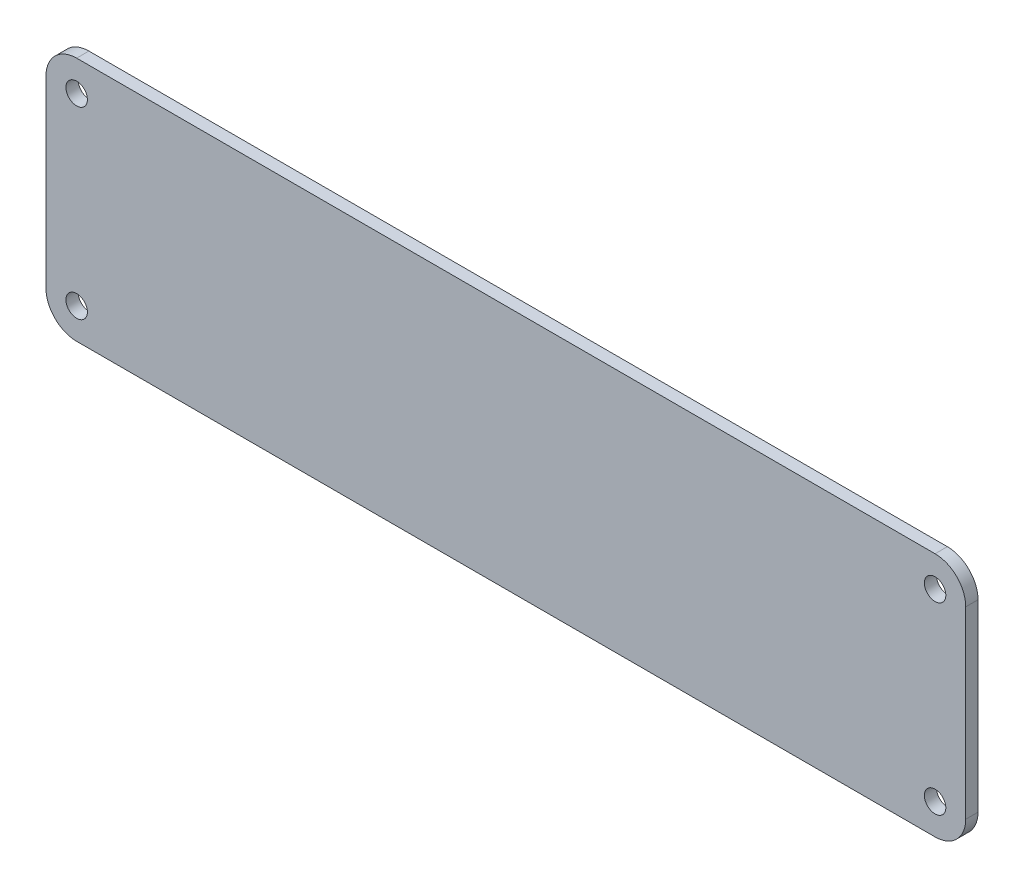
ISO-10303-21;
HEADER;
FILE_DESCRIPTION(('STEP AP214'),'2;1');
FILE_NAME('part.step','',(''),(''),'','','');
FILE_SCHEMA(('AUTOMOTIVE_DESIGN { 1 0 10303 214 1 1 1 1 }'));
ENDSEC;
DATA;
#1=APPLICATION_CONTEXT('core data for automotive mechanical design processes');
#2=APPLICATION_PROTOCOL_DEFINITION('international standard','automotive_design',2000,#1);
#3=PRODUCT_CONTEXT('',#1,'mechanical');
#4=PRODUCT('Part','Part','',(#3));
#5=PRODUCT_RELATED_PRODUCT_CATEGORY('part','',(#4));
#6=PRODUCT_DEFINITION_FORMATION('','',#4);
#7=PRODUCT_DEFINITION_CONTEXT('part definition',#1,'design');
#8=PRODUCT_DEFINITION('design','',#6,#7);
#9=PRODUCT_DEFINITION_SHAPE('','',#8);
#10=(LENGTH_UNIT() NAMED_UNIT(*) SI_UNIT(.MILLI.,.METRE.));
#11=(NAMED_UNIT(*) PLANE_ANGLE_UNIT() SI_UNIT($,.RADIAN.));
#12=(NAMED_UNIT(*) SI_UNIT($,.STERADIAN.) SOLID_ANGLE_UNIT());
#13=UNCERTAINTY_MEASURE_WITH_UNIT(LENGTH_MEASURE(1.E-05),#10,'distance_accuracy_value','');
#14=(GEOMETRIC_REPRESENTATION_CONTEXT(3) GLOBAL_UNCERTAINTY_ASSIGNED_CONTEXT((#13)) GLOBAL_UNIT_ASSIGNED_CONTEXT((#10,
#11,#12)) REPRESENTATION_CONTEXT('',''));
#15=CARTESIAN_POINT('',(0.,0.,0.));
#16=DIRECTION('',(0.,0.,1.));
#17=DIRECTION('',(1.,0.,0.));
#18=AXIS2_PLACEMENT_3D('',#15,#16,#17);
#19=CARTESIAN_POINT('',(-75.,-20.,2.));
#20=DIRECTION('',(1.,0.,0.));
#21=DIRECTION('',(0.,0.,-1.));
#22=AXIS2_PLACEMENT_3D('',#19,#20,#21);
#23=PLANE('',#22);
#24=DIRECTION('',(0.,-1.,0.));
#25=VECTOR('',#24,1.);
#26=CARTESIAN_POINT('',(-75.,-20.,0.));
#27=LINE('',#26,#25);
#28=CARTESIAN_POINT('',(-75.,15.,0.));
#29=VERTEX_POINT('',#28);
#30=CARTESIAN_POINT('',(-75.,-15.,0.));
#31=VERTEX_POINT('',#30);
#32=EDGE_CURVE('E133',#29,#31,#27,.T.);
#33=ORIENTED_EDGE('',*,*,#32,.T.);
#34=DIRECTION('',(0.,0.,-1.));
#35=VECTOR('',#34,1.);
#36=CARTESIAN_POINT('',(-75.,-15.,2.));
#37=LINE('',#36,#35);
#38=CARTESIAN_POINT('',(-75.,-15.,2.));
#39=VERTEX_POINT('',#38);
#40=EDGE_CURVE('E11',#31,#39,#37,.F.);
#41=ORIENTED_EDGE('',*,*,#40,.T.);
#42=DIRECTION('',(0.,-1.,0.));
#43=VECTOR('',#42,1.);
#44=CARTESIAN_POINT('',(-75.,-20.,2.));
#45=LINE('',#44,#43);
#46=CARTESIAN_POINT('',(-75.,15.,2.));
#47=VERTEX_POINT('',#46);
#48=EDGE_CURVE('E131',#47,#39,#45,.T.);
#49=ORIENTED_EDGE('',*,*,#48,.F.);
#50=DIRECTION('',(0.,0.,-1.));
#51=VECTOR('',#50,1.);
#52=CARTESIAN_POINT('',(-75.,15.,2.));
#53=LINE('',#52,#51);
#54=EDGE_CURVE('E45',#47,#29,#53,.T.);
#55=ORIENTED_EDGE('',*,*,#54,.T.);
#56=EDGE_LOOP('',(#33,#41,#49,#55));
#57=FACE_BOUND('',#56,.T.);
#58=ADVANCED_FACE('F37',(#57),#23,.F.);
#59=CARTESIAN_POINT('',(75.,-20.,2.));
#60=DIRECTION('',(0.,1.,0.));
#61=DIRECTION('',(-1.,0.,0.));
#62=AXIS2_PLACEMENT_3D('',#59,#60,#61);
#63=PLANE('',#62);
#64=DIRECTION('',(1.,0.,0.));
#65=VECTOR('',#64,1.);
#66=CARTESIAN_POINT('',(75.,-20.,0.));
#67=LINE('',#66,#65);
#68=CARTESIAN_POINT('',(-70.,-20.,0.));
#69=VERTEX_POINT('',#68);
#70=CARTESIAN_POINT('',(70.,-20.,0.));
#71=VERTEX_POINT('',#70);
#72=EDGE_CURVE('E129',#69,#71,#67,.T.);
#73=ORIENTED_EDGE('',*,*,#72,.T.);
#74=DIRECTION('',(0.,0.,-1.));
#75=VECTOR('',#74,1.);
#76=CARTESIAN_POINT('',(70.,-20.,2.));
#77=LINE('',#76,#75);
#78=CARTESIAN_POINT('',(70.,-20.,2.));
#79=VERTEX_POINT('',#78);
#80=EDGE_CURVE('E108',#71,#79,#77,.F.);
#81=ORIENTED_EDGE('',*,*,#80,.T.);
#82=DIRECTION('',(1.,0.,0.));
#83=VECTOR('',#82,1.);
#84=CARTESIAN_POINT('',(75.,-20.,2.));
#85=LINE('',#84,#83);
#86=CARTESIAN_POINT('',(-70.,-20.,2.));
#87=VERTEX_POINT('',#86);
#88=EDGE_CURVE('E173',#87,#79,#85,.T.);
#89=ORIENTED_EDGE('',*,*,#88,.F.);
#90=DIRECTION('',(0.,0.,-1.));
#91=VECTOR('',#90,1.);
#92=CARTESIAN_POINT('',(-70.,-20.,2.));
#93=LINE('',#92,#91);
#94=EDGE_CURVE('E113',#87,#69,#93,.T.);
#95=ORIENTED_EDGE('',*,*,#94,.T.);
#96=EDGE_LOOP('',(#73,#81,#89,#95));
#97=FACE_BOUND('',#96,.T.);
#98=ADVANCED_FACE('F211',(#97),#63,.F.);
#99=CARTESIAN_POINT('',(75.,-20.,2.));
#100=DIRECTION('',(-1.,0.,0.));
#101=DIRECTION('',(0.,0.,1.));
#102=AXIS2_PLACEMENT_3D('',#99,#100,#101);
#103=PLANE('',#102);
#104=DIRECTION('',(0.,1.,0.));
#105=VECTOR('',#104,1.);
#106=CARTESIAN_POINT('',(75.,-20.,2.));
#107=LINE('',#106,#105);
#108=CARTESIAN_POINT('',(75.,-15.,2.));
#109=VERTEX_POINT('',#108);
#110=CARTESIAN_POINT('',(75.,15.,2.));
#111=VERTEX_POINT('',#110);
#112=EDGE_CURVE('E122',#109,#111,#107,.T.);
#113=ORIENTED_EDGE('',*,*,#112,.F.);
#114=DIRECTION('',(0.,0.,-1.));
#115=VECTOR('',#114,1.);
#116=CARTESIAN_POINT('',(75.,-15.,2.));
#117=LINE('',#116,#115);
#118=CARTESIAN_POINT('',(75.,-15.,0.));
#119=VERTEX_POINT('',#118);
#120=EDGE_CURVE('E107',#109,#119,#117,.T.);
#121=ORIENTED_EDGE('',*,*,#120,.T.);
#122=DIRECTION('',(0.,1.,0.));
#123=VECTOR('',#122,1.);
#124=CARTESIAN_POINT('',(75.,-20.,0.));
#125=LINE('',#124,#123);
#126=CARTESIAN_POINT('',(75.,15.,0.));
#127=VERTEX_POINT('',#126);
#128=EDGE_CURVE('E120',#119,#127,#125,.T.);
#129=ORIENTED_EDGE('',*,*,#128,.T.);
#130=DIRECTION('',(0.,0.,-1.));
#131=VECTOR('',#130,1.);
#132=CARTESIAN_POINT('',(75.,15.,2.));
#133=LINE('',#132,#131);
#134=EDGE_CURVE('E124',#127,#111,#133,.F.);
#135=ORIENTED_EDGE('',*,*,#134,.T.);
#136=EDGE_LOOP('',(#113,#121,#129,#135));
#137=FACE_BOUND('',#136,.T.);
#138=ADVANCED_FACE('F119',(#137),#103,.F.);
#139=CARTESIAN_POINT('',(75.,20.,2.));
#140=DIRECTION('',(0.,-1.,0.));
#141=DIRECTION('',(1.,0.,0.));
#142=AXIS2_PLACEMENT_3D('',#139,#140,#141);
#143=PLANE('',#142);
#144=DIRECTION('',(-1.,0.,0.));
#145=VECTOR('',#144,1.);
#146=CARTESIAN_POINT('',(75.,20.,2.));
#147=LINE('',#146,#145);
#148=CARTESIAN_POINT('',(70.,20.,2.));
#149=VERTEX_POINT('',#148);
#150=CARTESIAN_POINT('',(-70.,20.,2.));
#151=VERTEX_POINT('',#150);
#152=EDGE_CURVE('E137',#149,#151,#147,.T.);
#153=ORIENTED_EDGE('',*,*,#152,.F.);
#154=DIRECTION('',(0.,0.,-1.));
#155=VECTOR('',#154,1.);
#156=CARTESIAN_POINT('',(70.,20.,2.));
#157=LINE('',#156,#155);
#158=CARTESIAN_POINT('',(70.,20.,0.));
#159=VERTEX_POINT('',#158);
#160=EDGE_CURVE('E154',#149,#159,#157,.T.);
#161=ORIENTED_EDGE('',*,*,#160,.T.);
#162=DIRECTION('',(-1.,0.,0.));
#163=VECTOR('',#162,1.);
#164=CARTESIAN_POINT('',(75.,20.,0.));
#165=LINE('',#164,#163);
#166=CARTESIAN_POINT('',(-70.,20.,0.));
#167=VERTEX_POINT('',#166);
#168=EDGE_CURVE('E128',#159,#167,#165,.T.);
#169=ORIENTED_EDGE('',*,*,#168,.T.);
#170=DIRECTION('',(0.,0.,-1.));
#171=VECTOR('',#170,1.);
#172=CARTESIAN_POINT('',(-70.,20.,2.));
#173=LINE('',#172,#171);
#174=EDGE_CURVE('E52',#167,#151,#173,.F.);
#175=ORIENTED_EDGE('',*,*,#174,.T.);
#176=EDGE_LOOP('',(#153,#161,#169,#175));
#177=FACE_BOUND('',#176,.T.);
#178=ADVANCED_FACE('F203',(#177),#143,.F.);
#179=CARTESIAN_POINT('',(0.,0.,2.));
#180=DIRECTION('',(0.,0.,1.));
#181=DIRECTION('',(1.,0.,0.));
#182=AXIS2_PLACEMENT_3D('',#179,#180,#181);
#183=PLANE('',#182);
#184=CARTESIAN_POINT('',(70.,15.,2.));
#185=DIRECTION('',(0.,0.,1.));
#186=DIRECTION('',(1.,0.,0.));
#187=AXIS2_PLACEMENT_3D('',#184,#185,#186);
#188=CIRCLE('',#187,1.75);
#189=CARTESIAN_POINT('',(71.75,15.,2.));
#190=VERTEX_POINT('',#189);
#191=EDGE_CURVE('E183',#190,#190,#188,.T.);
#192=ORIENTED_EDGE('',*,*,#191,.F.);
#193=EDGE_LOOP('',(#192));
#194=FACE_BOUND('',#193,.T.);
#195=CARTESIAN_POINT('',(70.,-15.,2.));
#196=DIRECTION('',(0.,0.,1.));
#197=DIRECTION('',(1.,0.,0.));
#198=AXIS2_PLACEMENT_3D('',#195,#196,#197);
#199=CIRCLE('',#198,1.75);
#200=CARTESIAN_POINT('',(71.75,-15.,2.));
#201=VERTEX_POINT('',#200);
#202=EDGE_CURVE('E189',#201,#201,#199,.T.);
#203=ORIENTED_EDGE('',*,*,#202,.F.);
#204=EDGE_LOOP('',(#203));
#205=FACE_BOUND('',#204,.T.);
#206=CARTESIAN_POINT('',(-70.,-15.,2.));
#207=DIRECTION('',(0.,0.,1.));
#208=DIRECTION('',(1.,0.,0.));
#209=AXIS2_PLACEMENT_3D('',#206,#207,#208);
#210=CIRCLE('',#209,1.75);
#211=CARTESIAN_POINT('',(-68.25,-15.,2.));
#212=VERTEX_POINT('',#211);
#213=EDGE_CURVE('E178',#212,#212,#210,.T.);
#214=ORIENTED_EDGE('',*,*,#213,.F.);
#215=EDGE_LOOP('',(#214));
#216=FACE_BOUND('',#215,.T.);
#217=CARTESIAN_POINT('',(-70.,15.,2.));
#218=DIRECTION('',(0.,0.,1.));
#219=DIRECTION('',(1.,0.,0.));
#220=AXIS2_PLACEMENT_3D('',#217,#218,#219);
#221=CIRCLE('',#220,1.75);
#222=CARTESIAN_POINT('',(-68.25,15.,2.));
#223=VERTEX_POINT('',#222);
#224=EDGE_CURVE('E168',#223,#223,#221,.T.);
#225=ORIENTED_EDGE('',*,*,#224,.F.);
#226=EDGE_LOOP('',(#225));
#227=FACE_BOUND('',#226,.T.);
#228=ORIENTED_EDGE('',*,*,#88,.T.);
#229=CARTESIAN_POINT('',(70.,-15.,2.));
#230=DIRECTION('',(0.,0.,1.));
#231=DIRECTION('',(1.,0.,0.));
#232=AXIS2_PLACEMENT_3D('',#229,#230,#231);
#233=CIRCLE('',#232,5.);
#234=EDGE_CURVE('E151',#79,#109,#233,.T.);
#235=ORIENTED_EDGE('',*,*,#234,.T.);
#236=ORIENTED_EDGE('',*,*,#112,.T.);
#237=CARTESIAN_POINT('',(70.,15.,2.));
#238=DIRECTION('',(0.,0.,1.));
#239=DIRECTION('',(1.,0.,0.));
#240=AXIS2_PLACEMENT_3D('',#237,#238,#239);
#241=CIRCLE('',#240,5.);
#242=EDGE_CURVE('E59',#111,#149,#241,.T.);
#243=ORIENTED_EDGE('',*,*,#242,.T.);
#244=ORIENTED_EDGE('',*,*,#152,.T.);
#245=CARTESIAN_POINT('',(-70.,15.,2.));
#246=DIRECTION('',(0.,0.,1.));
#247=DIRECTION('',(1.,0.,0.));
#248=AXIS2_PLACEMENT_3D('',#245,#246,#247);
#249=CIRCLE('',#248,5.);
#250=EDGE_CURVE('E146',#151,#47,#249,.T.);
#251=ORIENTED_EDGE('',*,*,#250,.T.);
#252=ORIENTED_EDGE('',*,*,#48,.T.);
#253=CARTESIAN_POINT('',(-70.,-15.,2.));
#254=DIRECTION('',(0.,0.,1.));
#255=DIRECTION('',(1.,0.,0.));
#256=AXIS2_PLACEMENT_3D('',#253,#254,#255);
#257=CIRCLE('',#256,5.);
#258=EDGE_CURVE('E148',#39,#87,#257,.T.);
#259=ORIENTED_EDGE('',*,*,#258,.T.);
#260=EDGE_LOOP('',(#228,#235,#236,#243,#244,#251,#252,#259));
#261=FACE_BOUND('',#260,.T.);
#262=ADVANCED_FACE('F200',(#194,#205,#216,#227,#261),#183,.T.);
#263=CARTESIAN_POINT('',(0.,0.,0.));
#264=DIRECTION('',(0.,0.,1.));
#265=DIRECTION('',(1.,0.,0.));
#266=AXIS2_PLACEMENT_3D('',#263,#264,#265);
#267=PLANE('',#266);
#268=CARTESIAN_POINT('',(70.,15.,0.));
#269=DIRECTION('',(0.,0.,1.));
#270=DIRECTION('',(1.,0.,0.));
#271=AXIS2_PLACEMENT_3D('',#268,#269,#270);
#272=CIRCLE('',#271,1.75);
#273=CARTESIAN_POINT('',(71.75,15.,0.));
#274=VERTEX_POINT('',#273);
#275=EDGE_CURVE('E180',#274,#274,#272,.T.);
#276=ORIENTED_EDGE('',*,*,#275,.T.);
#277=EDGE_LOOP('',(#276));
#278=FACE_BOUND('',#277,.T.);
#279=CARTESIAN_POINT('',(70.,-15.,0.));
#280=DIRECTION('',(0.,0.,1.));
#281=DIRECTION('',(1.,0.,0.));
#282=AXIS2_PLACEMENT_3D('',#279,#280,#281);
#283=CIRCLE('',#282,1.75);
#284=CARTESIAN_POINT('',(71.75,-15.,0.));
#285=VERTEX_POINT('',#284);
#286=EDGE_CURVE('E186',#285,#285,#283,.T.);
#287=ORIENTED_EDGE('',*,*,#286,.T.);
#288=EDGE_LOOP('',(#287));
#289=FACE_BOUND('',#288,.T.);
#290=CARTESIAN_POINT('',(-70.,-15.,0.));
#291=DIRECTION('',(0.,0.,1.));
#292=DIRECTION('',(1.,0.,0.));
#293=AXIS2_PLACEMENT_3D('',#290,#291,#292);
#294=CIRCLE('',#293,1.75);
#295=CARTESIAN_POINT('',(-68.25,-15.,0.));
#296=VERTEX_POINT('',#295);
#297=EDGE_CURVE('E192',#296,#296,#294,.T.);
#298=ORIENTED_EDGE('',*,*,#297,.T.);
#299=EDGE_LOOP('',(#298));
#300=FACE_BOUND('',#299,.T.);
#301=CARTESIAN_POINT('',(-70.,15.,0.));
#302=DIRECTION('',(0.,0.,1.));
#303=DIRECTION('',(1.,0.,0.));
#304=AXIS2_PLACEMENT_3D('',#301,#302,#303);
#305=CIRCLE('',#304,1.75);
#306=CARTESIAN_POINT('',(-68.25,15.,0.));
#307=VERTEX_POINT('',#306);
#308=EDGE_CURVE('E166',#307,#307,#305,.T.);
#309=ORIENTED_EDGE('',*,*,#308,.T.);
#310=EDGE_LOOP('',(#309));
#311=FACE_BOUND('',#310,.T.);
#312=ORIENTED_EDGE('',*,*,#128,.F.);
#313=CARTESIAN_POINT('',(70.,-15.,0.));
#314=DIRECTION('',(0.,0.,1.));
#315=DIRECTION('',(1.,0.,0.));
#316=AXIS2_PLACEMENT_3D('',#313,#314,#315);
#317=CIRCLE('',#316,5.);
#318=EDGE_CURVE('E103',#119,#71,#317,.F.);
#319=ORIENTED_EDGE('',*,*,#318,.T.);
#320=ORIENTED_EDGE('',*,*,#72,.F.);
#321=CARTESIAN_POINT('',(-70.,-15.,0.));
#322=DIRECTION('',(0.,0.,1.));
#323=DIRECTION('',(1.,0.,0.));
#324=AXIS2_PLACEMENT_3D('',#321,#322,#323);
#325=CIRCLE('',#324,5.);
#326=EDGE_CURVE('E140',#69,#31,#325,.F.);
#327=ORIENTED_EDGE('',*,*,#326,.T.);
#328=ORIENTED_EDGE('',*,*,#32,.F.);
#329=CARTESIAN_POINT('',(-70.,15.,0.));
#330=DIRECTION('',(0.,0.,1.));
#331=DIRECTION('',(1.,0.,0.));
#332=AXIS2_PLACEMENT_3D('',#329,#330,#331);
#333=CIRCLE('',#332,5.);
#334=EDGE_CURVE('E123',#29,#167,#333,.F.);
#335=ORIENTED_EDGE('',*,*,#334,.T.);
#336=ORIENTED_EDGE('',*,*,#168,.F.);
#337=CARTESIAN_POINT('',(70.,15.,0.));
#338=DIRECTION('',(0.,0.,1.));
#339=DIRECTION('',(1.,0.,0.));
#340=AXIS2_PLACEMENT_3D('',#337,#338,#339);
#341=CIRCLE('',#340,5.);
#342=EDGE_CURVE('E114',#159,#127,#341,.F.);
#343=ORIENTED_EDGE('',*,*,#342,.T.);
#344=EDGE_LOOP('',(#312,#319,#320,#327,#328,#335,#336,#343));
#345=FACE_BOUND('',#344,.T.);
#346=ADVANCED_FACE('F126',(#278,#289,#300,#311,#345),#267,.F.);
#347=CARTESIAN_POINT('',(-70.,15.,0.));
#348=DIRECTION('',(0.,0.,1.));
#349=DIRECTION('',(1.,0.,0.));
#350=AXIS2_PLACEMENT_3D('',#347,#348,#349);
#351=CYLINDRICAL_SURFACE('',#350,1.75);
#352=ORIENTED_EDGE('',*,*,#308,.F.);
#353=EDGE_LOOP('',(#352));
#354=FACE_BOUND('',#353,.T.);
#355=ORIENTED_EDGE('',*,*,#224,.T.);
#356=EDGE_LOOP('',(#355));
#357=FACE_BOUND('',#356,.T.);
#358=ADVANCED_FACE('F242',(#354,#357),#351,.F.);
#359=CARTESIAN_POINT('',(-70.,-15.,0.));
#360=DIRECTION('',(0.,0.,1.));
#361=DIRECTION('',(1.,0.,0.));
#362=AXIS2_PLACEMENT_3D('',#359,#360,#361);
#363=CYLINDRICAL_SURFACE('',#362,1.75);
#364=ORIENTED_EDGE('',*,*,#297,.F.);
#365=EDGE_LOOP('',(#364));
#366=FACE_BOUND('',#365,.T.);
#367=ORIENTED_EDGE('',*,*,#213,.T.);
#368=EDGE_LOOP('',(#367));
#369=FACE_BOUND('',#368,.T.);
#370=ADVANCED_FACE('F198',(#366,#369),#363,.F.);
#371=CARTESIAN_POINT('',(70.,-15.,0.));
#372=DIRECTION('',(0.,0.,1.));
#373=DIRECTION('',(1.,0.,0.));
#374=AXIS2_PLACEMENT_3D('',#371,#372,#373);
#375=CYLINDRICAL_SURFACE('',#374,1.75);
#376=ORIENTED_EDGE('',*,*,#286,.F.);
#377=EDGE_LOOP('',(#376));
#378=FACE_BOUND('',#377,.T.);
#379=ORIENTED_EDGE('',*,*,#202,.T.);
#380=EDGE_LOOP('',(#379));
#381=FACE_BOUND('',#380,.T.);
#382=ADVANCED_FACE('F250',(#378,#381),#375,.F.);
#383=CARTESIAN_POINT('',(70.,15.,0.));
#384=DIRECTION('',(0.,0.,1.));
#385=DIRECTION('',(1.,0.,0.));
#386=AXIS2_PLACEMENT_3D('',#383,#384,#385);
#387=CYLINDRICAL_SURFACE('',#386,1.75);
#388=ORIENTED_EDGE('',*,*,#275,.F.);
#389=EDGE_LOOP('',(#388));
#390=FACE_BOUND('',#389,.T.);
#391=ORIENTED_EDGE('',*,*,#191,.T.);
#392=EDGE_LOOP('',(#391));
#393=FACE_BOUND('',#392,.T.);
#394=ADVANCED_FACE('F229',(#390,#393),#387,.F.);
#395=CARTESIAN_POINT('',(70.,-15.,2.));
#396=DIRECTION('',(0.,0.,-1.));
#397=DIRECTION('',(-1.,0.,0.));
#398=AXIS2_PLACEMENT_3D('',#395,#396,#397);
#399=CYLINDRICAL_SURFACE('',#398,5.);
#400=ORIENTED_EDGE('',*,*,#234,.F.);
#401=ORIENTED_EDGE('',*,*,#80,.F.);
#402=ORIENTED_EDGE('',*,*,#318,.F.);
#403=ORIENTED_EDGE('',*,*,#120,.F.);
#404=EDGE_LOOP('',(#400,#401,#402,#403));
#405=FACE_BOUND('',#404,.T.);
#406=ADVANCED_FACE('F106',(#405),#399,.T.);
#407=CARTESIAN_POINT('',(70.,15.,2.));
#408=DIRECTION('',(0.,0.,-1.));
#409=DIRECTION('',(-1.,0.,0.));
#410=AXIS2_PLACEMENT_3D('',#407,#408,#409);
#411=CYLINDRICAL_SURFACE('',#410,5.);
#412=ORIENTED_EDGE('',*,*,#242,.F.);
#413=ORIENTED_EDGE('',*,*,#134,.F.);
#414=ORIENTED_EDGE('',*,*,#342,.F.);
#415=ORIENTED_EDGE('',*,*,#160,.F.);
#416=EDGE_LOOP('',(#412,#413,#414,#415));
#417=FACE_BOUND('',#416,.T.);
#418=ADVANCED_FACE('F218',(#417),#411,.T.);
#419=CARTESIAN_POINT('',(-70.,-15.,2.));
#420=DIRECTION('',(0.,0.,-1.));
#421=DIRECTION('',(-1.,0.,0.));
#422=AXIS2_PLACEMENT_3D('',#419,#420,#421);
#423=CYLINDRICAL_SURFACE('',#422,5.);
#424=ORIENTED_EDGE('',*,*,#258,.F.);
#425=ORIENTED_EDGE('',*,*,#40,.F.);
#426=ORIENTED_EDGE('',*,*,#326,.F.);
#427=ORIENTED_EDGE('',*,*,#94,.F.);
#428=EDGE_LOOP('',(#424,#425,#426,#427));
#429=FACE_BOUND('',#428,.T.);
#430=ADVANCED_FACE('F213',(#429),#423,.T.);
#431=CARTESIAN_POINT('',(-70.,15.,2.));
#432=DIRECTION('',(0.,0.,-1.));
#433=DIRECTION('',(-1.,0.,0.));
#434=AXIS2_PLACEMENT_3D('',#431,#432,#433);
#435=CYLINDRICAL_SURFACE('',#434,5.);
#436=ORIENTED_EDGE('',*,*,#250,.F.);
#437=ORIENTED_EDGE('',*,*,#174,.F.);
#438=ORIENTED_EDGE('',*,*,#334,.F.);
#439=ORIENTED_EDGE('',*,*,#54,.F.);
#440=EDGE_LOOP('',(#436,#437,#438,#439));
#441=FACE_BOUND('',#440,.T.);
#442=ADVANCED_FACE('F39',(#441),#435,.T.);
#443=CLOSED_SHELL('',(#58,#98,#138,#178,#262,#346,#358,#370,#382,#394,#406,#418,#430,#442));
#444=MANIFOLD_SOLID_BREP('B2',#443);
#445=ADVANCED_BREP_SHAPE_REPRESENTATION('',(#18,#444),#14);
#446=SHAPE_DEFINITION_REPRESENTATION(#9,#445);
ENDSEC;
END-ISO-10303-21;
